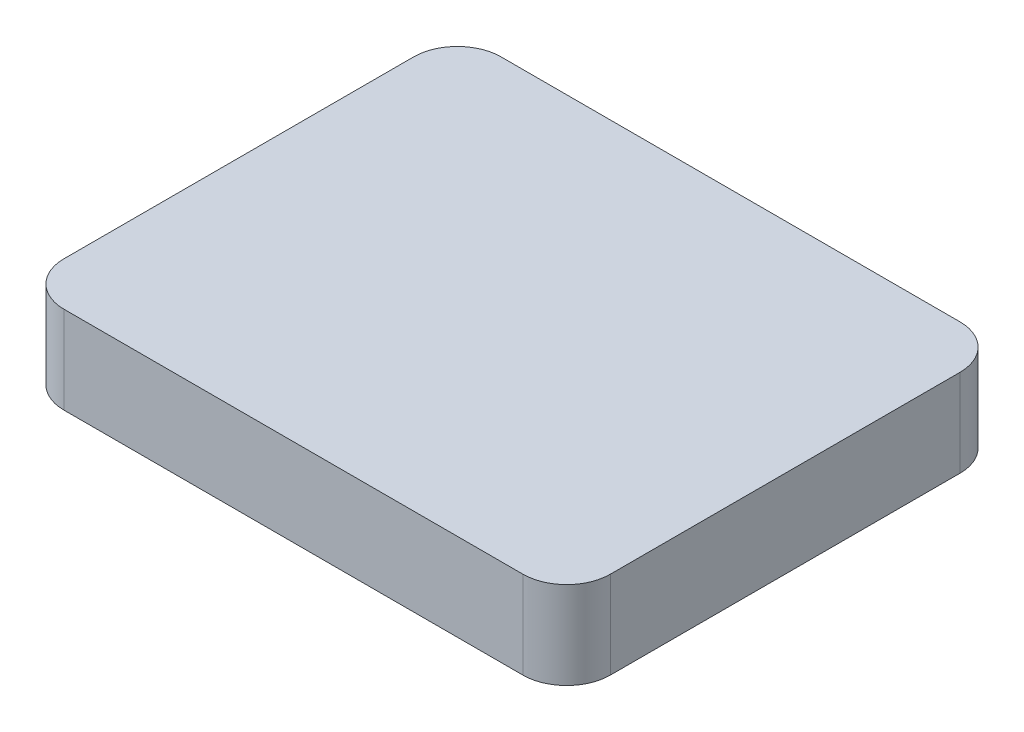
ISO-10303-21;
HEADER;
FILE_DESCRIPTION(('STEP AP214'),'2;1');
FILE_NAME('part.step','',(''),(''),'','','');
FILE_SCHEMA(('AUTOMOTIVE_DESIGN { 1 0 10303 214 1 1 1 1 }'));
ENDSEC;
DATA;
#1=APPLICATION_CONTEXT('core data for automotive mechanical design processes');
#2=APPLICATION_PROTOCOL_DEFINITION('international standard','automotive_design',2000,#1);
#3=PRODUCT_CONTEXT('',#1,'mechanical');
#4=PRODUCT('Part','Part','',(#3));
#5=PRODUCT_RELATED_PRODUCT_CATEGORY('part','',(#4));
#6=PRODUCT_DEFINITION_FORMATION('','',#4);
#7=PRODUCT_DEFINITION_CONTEXT('part definition',#1,'design');
#8=PRODUCT_DEFINITION('design','',#6,#7);
#9=PRODUCT_DEFINITION_SHAPE('','',#8);
#10=(LENGTH_UNIT() NAMED_UNIT(*) SI_UNIT(.MILLI.,.METRE.));
#11=(NAMED_UNIT(*) PLANE_ANGLE_UNIT() SI_UNIT($,.RADIAN.));
#12=(NAMED_UNIT(*) SI_UNIT($,.STERADIAN.) SOLID_ANGLE_UNIT());
#13=UNCERTAINTY_MEASURE_WITH_UNIT(LENGTH_MEASURE(1.E-05),#10,'distance_accuracy_value','');
#14=(GEOMETRIC_REPRESENTATION_CONTEXT(3) GLOBAL_UNCERTAINTY_ASSIGNED_CONTEXT((#13)) GLOBAL_UNIT_ASSIGNED_CONTEXT((#10,
#11,#12)) REPRESENTATION_CONTEXT('',''));
#15=CARTESIAN_POINT('',(0.,0.,0.));
#16=DIRECTION('',(0.,0.,1.));
#17=DIRECTION('',(1.,0.,0.));
#18=AXIS2_PLACEMENT_3D('',#15,#16,#17);
#19=CARTESIAN_POINT('',(125.,40.,-100.));
#20=DIRECTION('',(-1.,0.,0.));
#21=DIRECTION('',(0.,0.,1.));
#22=AXIS2_PLACEMENT_3D('',#19,#20,#21);
#23=PLANE('',#22);
#24=DIRECTION('',(0.,0.,-1.));
#25=VECTOR('',#24,1.);
#26=CARTESIAN_POINT('',(125.,0.,-100.));
#27=LINE('',#26,#25);
#28=CARTESIAN_POINT('',(125.,0.,80.));
#29=VERTEX_POINT('',#28);
#30=CARTESIAN_POINT('',(125.,0.,-80.));
#31=VERTEX_POINT('',#30);
#32=EDGE_CURVE('E158',#29,#31,#27,.T.);
#33=ORIENTED_EDGE('',*,*,#32,.T.);
#34=DIRECTION('',(0.,-1.,0.));
#35=VECTOR('',#34,1.);
#36=CARTESIAN_POINT('',(125.,40.,-80.));
#37=LINE('',#36,#35);
#38=CARTESIAN_POINT('',(125.,40.,-80.));
#39=VERTEX_POINT('',#38);
#40=EDGE_CURVE('E11',#31,#39,#37,.F.);
#41=ORIENTED_EDGE('',*,*,#40,.T.);
#42=DIRECTION('',(0.,0.,-1.));
#43=VECTOR('',#42,1.);
#44=CARTESIAN_POINT('',(125.,40.,-100.));
#45=LINE('',#44,#43);
#46=CARTESIAN_POINT('',(125.,40.,80.));
#47=VERTEX_POINT('',#46);
#48=EDGE_CURVE('E126',#47,#39,#45,.T.);
#49=ORIENTED_EDGE('',*,*,#48,.F.);
#50=DIRECTION('',(0.,-1.,0.));
#51=VECTOR('',#50,1.);
#52=CARTESIAN_POINT('',(125.,40.,80.));
#53=LINE('',#52,#51);
#54=EDGE_CURVE('E42',#47,#29,#53,.T.);
#55=ORIENTED_EDGE('',*,*,#54,.T.);
#56=EDGE_LOOP('',(#33,#41,#49,#55));
#57=FACE_BOUND('',#56,.T.);
#58=ADVANCED_FACE('F34',(#57),#23,.F.);
#59=CARTESIAN_POINT('',(-125.,40.,-100.));
#60=DIRECTION('',(0.,0.,1.));
#61=DIRECTION('',(1.,0.,0.));
#62=AXIS2_PLACEMENT_3D('',#59,#60,#61);
#63=PLANE('',#62);
#64=DIRECTION('',(-1.,0.,0.));
#65=VECTOR('',#64,1.);
#66=CARTESIAN_POINT('',(-125.,0.,-100.));
#67=LINE('',#66,#65);
#68=CARTESIAN_POINT('',(105.,0.,-100.));
#69=VERTEX_POINT('',#68);
#70=CARTESIAN_POINT('',(-105.,0.,-100.));
#71=VERTEX_POINT('',#70);
#72=EDGE_CURVE('E131',#69,#71,#67,.T.);
#73=ORIENTED_EDGE('',*,*,#72,.T.);
#74=DIRECTION('',(0.,-1.,0.));
#75=VECTOR('',#74,1.);
#76=CARTESIAN_POINT('',(-105.,40.,-100.));
#77=LINE('',#76,#75);
#78=CARTESIAN_POINT('',(-105.,40.,-100.));
#79=VERTEX_POINT('',#78);
#80=EDGE_CURVE('E49',#71,#79,#77,.F.);
#81=ORIENTED_EDGE('',*,*,#80,.T.);
#82=DIRECTION('',(-1.,0.,0.));
#83=VECTOR('',#82,1.);
#84=CARTESIAN_POINT('',(-125.,40.,-100.));
#85=LINE('',#84,#83);
#86=CARTESIAN_POINT('',(105.,40.,-100.));
#87=VERTEX_POINT('',#86);
#88=EDGE_CURVE('E129',#87,#79,#85,.T.);
#89=ORIENTED_EDGE('',*,*,#88,.F.);
#90=DIRECTION('',(0.,-1.,0.));
#91=VECTOR('',#90,1.);
#92=CARTESIAN_POINT('',(105.,40.,-100.));
#93=LINE('',#92,#91);
#94=EDGE_CURVE('E150',#87,#69,#93,.T.);
#95=ORIENTED_EDGE('',*,*,#94,.T.);
#96=EDGE_LOOP('',(#73,#81,#89,#95));
#97=FACE_BOUND('',#96,.T.);
#98=ADVANCED_FACE('F178',(#97),#63,.F.);
#99=CARTESIAN_POINT('',(-125.,40.,-100.));
#100=DIRECTION('',(1.,0.,0.));
#101=DIRECTION('',(0.,0.,-1.));
#102=AXIS2_PLACEMENT_3D('',#99,#100,#101);
#103=PLANE('',#102);
#104=DIRECTION('',(0.,0.,1.));
#105=VECTOR('',#104,1.);
#106=CARTESIAN_POINT('',(-125.,0.,-100.));
#107=LINE('',#106,#105);
#108=CARTESIAN_POINT('',(-125.,0.,-80.));
#109=VERTEX_POINT('',#108);
#110=CARTESIAN_POINT('',(-125.,0.,80.));
#111=VERTEX_POINT('',#110);
#112=EDGE_CURVE('E127',#109,#111,#107,.T.);
#113=ORIENTED_EDGE('',*,*,#112,.T.);
#114=DIRECTION('',(0.,-1.,0.));
#115=VECTOR('',#114,1.);
#116=CARTESIAN_POINT('',(-125.,40.,80.));
#117=LINE('',#116,#115);
#118=CARTESIAN_POINT('',(-125.,40.,80.));
#119=VERTEX_POINT('',#118);
#120=EDGE_CURVE('E105',#111,#119,#117,.F.);
#121=ORIENTED_EDGE('',*,*,#120,.T.);
#122=DIRECTION('',(0.,0.,1.));
#123=VECTOR('',#122,1.);
#124=CARTESIAN_POINT('',(-125.,40.,-100.));
#125=LINE('',#124,#123);
#126=CARTESIAN_POINT('',(-125.,40.,-80.));
#127=VERTEX_POINT('',#126);
#128=EDGE_CURVE('E166',#127,#119,#125,.T.);
#129=ORIENTED_EDGE('',*,*,#128,.F.);
#130=DIRECTION('',(0.,-1.,0.));
#131=VECTOR('',#130,1.);
#132=CARTESIAN_POINT('',(-125.,40.,-80.));
#133=LINE('',#132,#131);
#134=EDGE_CURVE('E110',#127,#109,#133,.T.);
#135=ORIENTED_EDGE('',*,*,#134,.T.);
#136=EDGE_LOOP('',(#113,#121,#129,#135));
#137=FACE_BOUND('',#136,.T.);
#138=ADVANCED_FACE('F177',(#137),#103,.F.);
#139=CARTESIAN_POINT('',(-125.,40.,100.));
#140=DIRECTION('',(0.,0.,-1.));
#141=DIRECTION('',(-1.,0.,0.));
#142=AXIS2_PLACEMENT_3D('',#139,#140,#141);
#143=PLANE('',#142);
#144=DIRECTION('',(1.,0.,0.));
#145=VECTOR('',#144,1.);
#146=CARTESIAN_POINT('',(-125.,40.,100.));
#147=LINE('',#146,#145);
#148=CARTESIAN_POINT('',(-105.,40.,100.));
#149=VERTEX_POINT('',#148);
#150=CARTESIAN_POINT('',(105.,40.,100.));
#151=VERTEX_POINT('',#150);
#152=EDGE_CURVE('E120',#149,#151,#147,.T.);
#153=ORIENTED_EDGE('',*,*,#152,.F.);
#154=DIRECTION('',(0.,-1.,0.));
#155=VECTOR('',#154,1.);
#156=CARTESIAN_POINT('',(-105.,40.,100.));
#157=LINE('',#156,#155);
#158=CARTESIAN_POINT('',(-105.,0.,100.));
#159=VERTEX_POINT('',#158);
#160=EDGE_CURVE('E104',#149,#159,#157,.T.);
#161=ORIENTED_EDGE('',*,*,#160,.T.);
#162=DIRECTION('',(1.,0.,0.));
#163=VECTOR('',#162,1.);
#164=CARTESIAN_POINT('',(-125.,0.,100.));
#165=LINE('',#164,#163);
#166=CARTESIAN_POINT('',(105.,0.,100.));
#167=VERTEX_POINT('',#166);
#168=EDGE_CURVE('E117',#159,#167,#165,.T.);
#169=ORIENTED_EDGE('',*,*,#168,.T.);
#170=DIRECTION('',(0.,-1.,0.));
#171=VECTOR('',#170,1.);
#172=CARTESIAN_POINT('',(105.,40.,100.));
#173=LINE('',#172,#171);
#174=EDGE_CURVE('E122',#167,#151,#173,.F.);
#175=ORIENTED_EDGE('',*,*,#174,.T.);
#176=EDGE_LOOP('',(#153,#161,#169,#175));
#177=FACE_BOUND('',#176,.T.);
#178=ADVANCED_FACE('F116',(#177),#143,.F.);
#179=CARTESIAN_POINT('',(0.,40.,0.));
#180=DIRECTION('',(0.,1.,0.));
#181=DIRECTION('',(0.,0.,1.));
#182=AXIS2_PLACEMENT_3D('',#179,#180,#181);
#183=PLANE('',#182);
#184=ORIENTED_EDGE('',*,*,#128,.T.);
#185=CARTESIAN_POINT('',(-105.,40.,80.));
#186=DIRECTION('',(0.,1.,0.));
#187=DIRECTION('',(0.,0.,1.));
#188=AXIS2_PLACEMENT_3D('',#185,#186,#187);
#189=CIRCLE('',#188,20.);
#190=EDGE_CURVE('E148',#119,#149,#189,.T.);
#191=ORIENTED_EDGE('',*,*,#190,.T.);
#192=ORIENTED_EDGE('',*,*,#152,.T.);
#193=CARTESIAN_POINT('',(105.,40.,80.));
#194=DIRECTION('',(0.,1.,0.));
#195=DIRECTION('',(0.,0.,1.));
#196=AXIS2_PLACEMENT_3D('',#193,#194,#195);
#197=CIRCLE('',#196,20.);
#198=EDGE_CURVE('E143',#151,#47,#197,.T.);
#199=ORIENTED_EDGE('',*,*,#198,.T.);
#200=ORIENTED_EDGE('',*,*,#48,.T.);
#201=CARTESIAN_POINT('',(105.,40.,-80.));
#202=DIRECTION('',(0.,1.,0.));
#203=DIRECTION('',(0.,0.,1.));
#204=AXIS2_PLACEMENT_3D('',#201,#202,#203);
#205=CIRCLE('',#204,20.);
#206=EDGE_CURVE('E56',#39,#87,#205,.T.);
#207=ORIENTED_EDGE('',*,*,#206,.T.);
#208=ORIENTED_EDGE('',*,*,#88,.T.);
#209=CARTESIAN_POINT('',(-105.,40.,-80.));
#210=DIRECTION('',(0.,1.,0.));
#211=DIRECTION('',(0.,0.,1.));
#212=AXIS2_PLACEMENT_3D('',#209,#210,#211);
#213=CIRCLE('',#212,20.);
#214=EDGE_CURVE('E146',#79,#127,#213,.T.);
#215=ORIENTED_EDGE('',*,*,#214,.T.);
#216=EDGE_LOOP('',(#184,#191,#192,#199,#200,#207,#208,#215));
#217=FACE_BOUND('',#216,.T.);
#218=ADVANCED_FACE('F170',(#217),#183,.T.);
#219=CARTESIAN_POINT('',(0.,0.,0.));
#220=DIRECTION('',(0.,1.,0.));
#221=DIRECTION('',(0.,0.,1.));
#222=AXIS2_PLACEMENT_3D('',#219,#220,#221);
#223=PLANE('',#222);
#224=ORIENTED_EDGE('',*,*,#168,.F.);
#225=CARTESIAN_POINT('',(-105.,0.,80.));
#226=DIRECTION('',(0.,1.,0.));
#227=DIRECTION('',(0.,0.,1.));
#228=AXIS2_PLACEMENT_3D('',#225,#226,#227);
#229=CIRCLE('',#228,20.);
#230=EDGE_CURVE('E100',#159,#111,#229,.F.);
#231=ORIENTED_EDGE('',*,*,#230,.T.);
#232=ORIENTED_EDGE('',*,*,#112,.F.);
#233=CARTESIAN_POINT('',(-105.,0.,-80.));
#234=DIRECTION('',(0.,1.,0.));
#235=DIRECTION('',(0.,0.,1.));
#236=AXIS2_PLACEMENT_3D('',#233,#234,#235);
#237=CIRCLE('',#236,20.);
#238=EDGE_CURVE('E111',#109,#71,#237,.F.);
#239=ORIENTED_EDGE('',*,*,#238,.T.);
#240=ORIENTED_EDGE('',*,*,#72,.F.);
#241=CARTESIAN_POINT('',(105.,0.,-80.));
#242=DIRECTION('',(0.,1.,0.));
#243=DIRECTION('',(0.,0.,1.));
#244=AXIS2_PLACEMENT_3D('',#241,#242,#243);
#245=CIRCLE('',#244,20.);
#246=EDGE_CURVE('E137',#69,#31,#245,.F.);
#247=ORIENTED_EDGE('',*,*,#246,.T.);
#248=ORIENTED_EDGE('',*,*,#32,.F.);
#249=CARTESIAN_POINT('',(105.,0.,80.));
#250=DIRECTION('',(0.,1.,0.));
#251=DIRECTION('',(0.,0.,1.));
#252=AXIS2_PLACEMENT_3D('',#249,#250,#251);
#253=CIRCLE('',#252,20.);
#254=EDGE_CURVE('E121',#29,#167,#253,.F.);
#255=ORIENTED_EDGE('',*,*,#254,.T.);
#256=EDGE_LOOP('',(#224,#231,#232,#239,#240,#247,#248,#255));
#257=FACE_BOUND('',#256,.T.);
#258=ADVANCED_FACE('F124',(#257),#223,.F.);
#259=CARTESIAN_POINT('',(-105.,40.,80.));
#260=DIRECTION('',(0.,-1.,0.));
#261=DIRECTION('',(0.,0.,-1.));
#262=AXIS2_PLACEMENT_3D('',#259,#260,#261);
#263=CYLINDRICAL_SURFACE('',#262,20.);
#264=ORIENTED_EDGE('',*,*,#190,.F.);
#265=ORIENTED_EDGE('',*,*,#120,.F.);
#266=ORIENTED_EDGE('',*,*,#230,.F.);
#267=ORIENTED_EDGE('',*,*,#160,.F.);
#268=EDGE_LOOP('',(#264,#265,#266,#267));
#269=FACE_BOUND('',#268,.T.);
#270=ADVANCED_FACE('F103',(#269),#263,.T.);
#271=CARTESIAN_POINT('',(-105.,40.,-80.));
#272=DIRECTION('',(0.,-1.,0.));
#273=DIRECTION('',(0.,0.,-1.));
#274=AXIS2_PLACEMENT_3D('',#271,#272,#273);
#275=CYLINDRICAL_SURFACE('',#274,20.);
#276=ORIENTED_EDGE('',*,*,#214,.F.);
#277=ORIENTED_EDGE('',*,*,#80,.F.);
#278=ORIENTED_EDGE('',*,*,#238,.F.);
#279=ORIENTED_EDGE('',*,*,#134,.F.);
#280=EDGE_LOOP('',(#276,#277,#278,#279));
#281=FACE_BOUND('',#280,.T.);
#282=ADVANCED_FACE('F175',(#281),#275,.T.);
#283=CARTESIAN_POINT('',(105.,40.,-80.));
#284=DIRECTION('',(0.,-1.,0.));
#285=DIRECTION('',(0.,0.,-1.));
#286=AXIS2_PLACEMENT_3D('',#283,#284,#285);
#287=CYLINDRICAL_SURFACE('',#286,20.);
#288=ORIENTED_EDGE('',*,*,#206,.F.);
#289=ORIENTED_EDGE('',*,*,#40,.F.);
#290=ORIENTED_EDGE('',*,*,#246,.F.);
#291=ORIENTED_EDGE('',*,*,#94,.F.);
#292=EDGE_LOOP('',(#288,#289,#290,#291));
#293=FACE_BOUND('',#292,.T.);
#294=ADVANCED_FACE('F180',(#293),#287,.T.);
#295=CARTESIAN_POINT('',(105.,40.,80.));
#296=DIRECTION('',(0.,-1.,0.));
#297=DIRECTION('',(0.,0.,-1.));
#298=AXIS2_PLACEMENT_3D('',#295,#296,#297);
#299=CYLINDRICAL_SURFACE('',#298,20.);
#300=ORIENTED_EDGE('',*,*,#198,.F.);
#301=ORIENTED_EDGE('',*,*,#174,.F.);
#302=ORIENTED_EDGE('',*,*,#254,.F.);
#303=ORIENTED_EDGE('',*,*,#54,.F.);
#304=EDGE_LOOP('',(#300,#301,#302,#303));
#305=FACE_BOUND('',#304,.T.);
#306=ADVANCED_FACE('F36',(#305),#299,.T.);
#307=CLOSED_SHELL('',(#58,#98,#138,#178,#218,#258,#270,#282,#294,#306));
#308=MANIFOLD_SOLID_BREP('B2',#307);
#309=ADVANCED_BREP_SHAPE_REPRESENTATION('',(#18,#308),#14);
#310=SHAPE_DEFINITION_REPRESENTATION(#9,#309);
ENDSEC;
END-ISO-10303-21;
